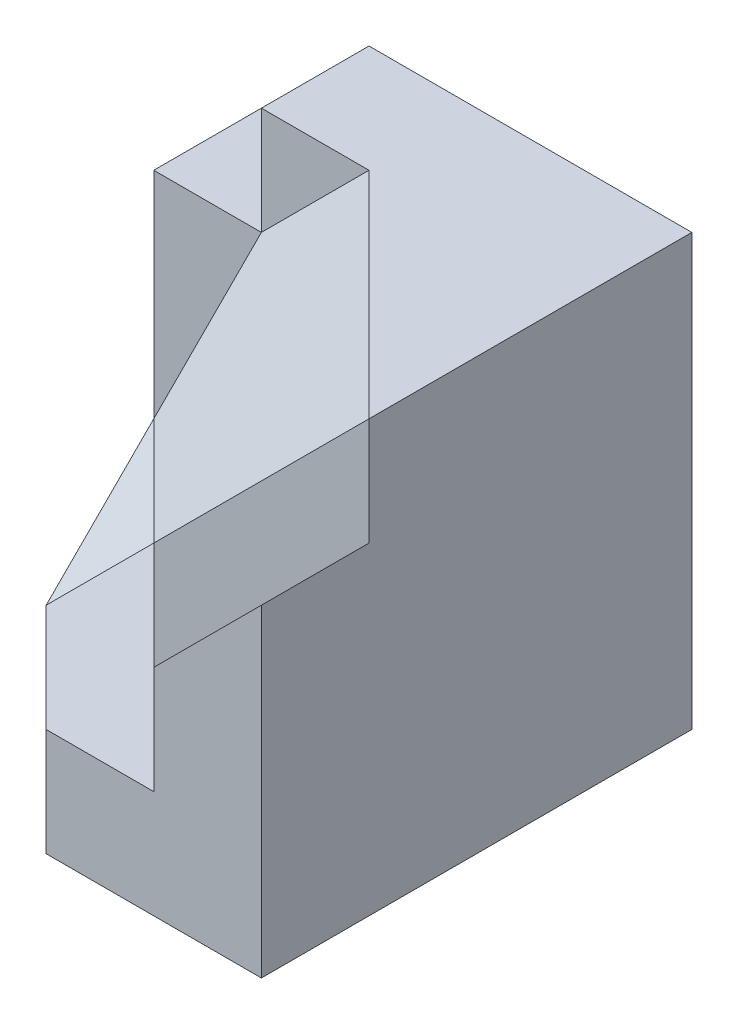
ISO-10303-21;
HEADER;
FILE_DESCRIPTION(('STEP AP214'),'2;1');
FILE_NAME('part.step','',(''),(''),'','','');
FILE_SCHEMA(('AUTOMOTIVE_DESIGN { 1 0 10303 214 1 1 1 1 }'));
ENDSEC;
DATA;
#1=APPLICATION_CONTEXT('core data for automotive mechanical design processes');
#2=APPLICATION_PROTOCOL_DEFINITION('international standard','automotive_design',2000,#1);
#3=PRODUCT_CONTEXT('',#1,'mechanical');
#4=PRODUCT('Part','Part','',(#3));
#5=PRODUCT_RELATED_PRODUCT_CATEGORY('part','',(#4));
#6=PRODUCT_DEFINITION_FORMATION('','',#4);
#7=PRODUCT_DEFINITION_CONTEXT('part definition',#1,'design');
#8=PRODUCT_DEFINITION('design','',#6,#7);
#9=PRODUCT_DEFINITION_SHAPE('','',#8);
#10=(LENGTH_UNIT() NAMED_UNIT(*) SI_UNIT(.MILLI.,.METRE.));
#11=(NAMED_UNIT(*) PLANE_ANGLE_UNIT() SI_UNIT($,.RADIAN.));
#12=(NAMED_UNIT(*) SI_UNIT($,.STERADIAN.) SOLID_ANGLE_UNIT());
#13=UNCERTAINTY_MEASURE_WITH_UNIT(LENGTH_MEASURE(1.E-05),#10,'distance_accuracy_value','');
#14=(GEOMETRIC_REPRESENTATION_CONTEXT(3) GLOBAL_UNCERTAINTY_ASSIGNED_CONTEXT((#13)) GLOBAL_UNIT_ASSIGNED_CONTEXT((#10,
#11,#12)) REPRESENTATION_CONTEXT('',''));
#15=CARTESIAN_POINT('',(0.,0.,0.));
#16=DIRECTION('',(0.,0.,1.));
#17=DIRECTION('',(1.,0.,0.));
#18=AXIS2_PLACEMENT_3D('',#15,#16,#17);
#19=CARTESIAN_POINT('',(-12.5,20.,12.5));
#20=DIRECTION('',(-0.707106781186547,0.,0.707106781186548));
#21=DIRECTION('',(0.707106781186548,0.,0.707106781186547));
#22=AXIS2_PLACEMENT_3D('',#19,#20,#21);
#23=PLANE('',#22);
#24=DIRECTION('',(0.,-1.,0.));
#25=VECTOR('',#24,1.);
#26=CARTESIAN_POINT('',(-15.,20.,10.));
#27=LINE('',#26,#25);
#28=CARTESIAN_POINT('',(-15.,10.,10.));
#29=VERTEX_POINT('',#28);
#30=CARTESIAN_POINT('',(-15.,5.,10.));
#31=VERTEX_POINT('',#30);
#32=EDGE_CURVE('E161',#29,#31,#27,.T.);
#33=ORIENTED_EDGE('',*,*,#32,.T.);
#34=DIRECTION('',(0.707106781186548,0.,0.707106781186547));
#35=VECTOR('',#34,1.);
#36=CARTESIAN_POINT('',(-15.,5.,10.));
#37=LINE('',#36,#35);
#38=CARTESIAN_POINT('',(-10.,5.,15.));
#39=VERTEX_POINT('',#38);
#40=EDGE_CURVE('E146',#31,#39,#37,.T.);
#41=ORIENTED_EDGE('',*,*,#40,.T.);
#42=DIRECTION('',(0.,-1.,0.));
#43=VECTOR('',#42,1.);
#44=CARTESIAN_POINT('',(-10.,20.,15.));
#45=LINE('',#44,#43);
#46=CARTESIAN_POINT('',(-10.,10.,15.));
#47=VERTEX_POINT('',#46);
#48=EDGE_CURVE('E171',#47,#39,#45,.T.);
#49=ORIENTED_EDGE('',*,*,#48,.F.);
#50=DIRECTION('',(-0.707106781186548,0.,-0.707106781186547));
#51=VECTOR('',#50,1.);
#52=CARTESIAN_POINT('',(-10.,10.,15.));
#53=LINE('',#52,#51);
#54=EDGE_CURVE('E167',#47,#29,#53,.T.);
#55=ORIENTED_EDGE('',*,*,#54,.T.);
#56=EDGE_LOOP('',(#33,#41,#49,#55));
#57=FACE_BOUND('',#56,.T.);
#58=ADVANCED_FACE('F36',(#57),#23,.T.);
#59=CARTESIAN_POINT('',(0.,20.,15.));
#60=DIRECTION('',(0.,0.,1.));
#61=DIRECTION('',(1.,0.,0.));
#62=AXIS2_PLACEMENT_3D('',#59,#60,#61);
#63=PLANE('',#62);
#64=ORIENTED_EDGE('',*,*,#48,.T.);
#65=DIRECTION('',(1.,0.,0.));
#66=VECTOR('',#65,1.);
#67=CARTESIAN_POINT('',(-10.,5.,15.));
#68=LINE('',#67,#66);
#69=CARTESIAN_POINT('',(-5.,5.,15.));
#70=VERTEX_POINT('',#69);
#71=EDGE_CURVE('E153',#39,#70,#68,.T.);
#72=ORIENTED_EDGE('',*,*,#71,.T.);
#73=DIRECTION('',(0.,-1.,0.));
#74=VECTOR('',#73,1.);
#75=CARTESIAN_POINT('',(-5.,0.,15.));
#76=LINE('',#75,#74);
#77=CARTESIAN_POINT('',(-5.,10.,15.));
#78=VERTEX_POINT('',#77);
#79=EDGE_CURVE('E268',#78,#70,#76,.T.);
#80=ORIENTED_EDGE('',*,*,#79,.F.);
#81=DIRECTION('',(0.707106781186547,0.707106781186548,0.));
#82=VECTOR('',#81,1.);
#83=CARTESIAN_POINT('',(-5.,10.,15.));
#84=LINE('',#83,#82);
#85=CARTESIAN_POINT('',(0.,15.,15.));
#86=VERTEX_POINT('',#85);
#87=EDGE_CURVE('E272',#78,#86,#84,.T.);
#88=ORIENTED_EDGE('',*,*,#87,.T.);
#89=DIRECTION('',(0.,-1.,0.));
#90=VECTOR('',#89,1.);
#91=CARTESIAN_POINT('',(0.,20.,15.));
#92=LINE('',#91,#90);
#93=CARTESIAN_POINT('',(0.,20.,15.));
#94=VERTEX_POINT('',#93);
#95=EDGE_CURVE('E12',#94,#86,#92,.T.);
#96=ORIENTED_EDGE('',*,*,#95,.F.);
#97=DIRECTION('',(-0.707106781186548,-0.707106781186548,0.));
#98=VECTOR('',#97,1.);
#99=CARTESIAN_POINT('',(0.,20.,15.));
#100=LINE('',#99,#98);
#101=EDGE_CURVE('E61',#94,#47,#100,.T.);
#102=ORIENTED_EDGE('',*,*,#101,.T.);
#103=EDGE_LOOP('',(#64,#72,#80,#88,#96,#102));
#104=FACE_BOUND('',#103,.T.);
#105=ADVANCED_FACE('F305',(#104),#63,.T.);
#106=CARTESIAN_POINT('',(-5.,0.,20.));
#107=DIRECTION('',(1.,0.,0.));
#108=DIRECTION('',(0.,0.,-1.));
#109=AXIS2_PLACEMENT_3D('',#106,#107,#108);
#110=PLANE('',#109);
#111=DIRECTION('',(0.,0.,1.));
#112=VECTOR('',#111,1.);
#113=CARTESIAN_POINT('',(-5.,5.,15.));
#114=LINE('',#113,#112);
#115=CARTESIAN_POINT('',(-5.,5.,20.));
#116=VERTEX_POINT('',#115);
#117=EDGE_CURVE('E356',#70,#116,#114,.T.);
#118=ORIENTED_EDGE('',*,*,#117,.T.);
#119=DIRECTION('',(0.,-1.,0.));
#120=VECTOR('',#119,1.);
#121=CARTESIAN_POINT('',(-5.,0.,20.));
#122=LINE('',#121,#120);
#123=CARTESIAN_POINT('',(-5.,10.,20.));
#124=VERTEX_POINT('',#123);
#125=EDGE_CURVE('E346',#124,#116,#122,.T.);
#126=ORIENTED_EDGE('',*,*,#125,.F.);
#127=DIRECTION('',(0.,0.,1.));
#128=VECTOR('',#127,1.);
#129=CARTESIAN_POINT('',(-5.,10.,15.));
#130=LINE('',#129,#128);
#131=EDGE_CURVE('E53',#78,#124,#130,.T.);
#132=ORIENTED_EDGE('',*,*,#131,.F.);
#133=ORIENTED_EDGE('',*,*,#79,.T.);
#134=EDGE_LOOP('',(#118,#126,#132,#133));
#135=FACE_BOUND('',#134,.T.);
#136=ADVANCED_FACE('F355',(#135),#110,.F.);
#137=CARTESIAN_POINT('',(-15.,20.,5.));
#138=DIRECTION('',(1.,0.,0.));
#139=DIRECTION('',(0.,0.,-1.));
#140=AXIS2_PLACEMENT_3D('',#137,#138,#139);
#141=PLANE('',#140);
#142=DIRECTION('',(0.,0.707106781186547,-0.707106781186548));
#143=VECTOR('',#142,1.);
#144=CARTESIAN_POINT('',(-15.,10.,10.));
#145=LINE('',#144,#143);
#146=CARTESIAN_POINT('',(-15.,15.,5.));
#147=VERTEX_POINT('',#146);
#148=EDGE_CURVE('E264',#29,#147,#145,.T.);
#149=ORIENTED_EDGE('',*,*,#148,.T.);
#150=DIRECTION('',(0.,-1.,0.));
#151=VECTOR('',#150,1.);
#152=CARTESIAN_POINT('',(-15.,20.,5.));
#153=LINE('',#152,#151);
#154=CARTESIAN_POINT('',(-15.,5.,5.));
#155=VERTEX_POINT('',#154);
#156=EDGE_CURVE('E168',#147,#155,#153,.T.);
#157=ORIENTED_EDGE('',*,*,#156,.T.);
#158=DIRECTION('',(0.,0.707106781186547,-0.707106781186548));
#159=VECTOR('',#158,1.);
#160=CARTESIAN_POINT('',(-15.,5.,5.));
#161=LINE('',#160,#159);
#162=CARTESIAN_POINT('',(-15.,0.,10.));
#163=VERTEX_POINT('',#162);
#164=EDGE_CURVE('E205',#163,#155,#161,.T.);
#165=ORIENTED_EDGE('',*,*,#164,.F.);
#166=DIRECTION('',(0.,0.,-1.));
#167=VECTOR('',#166,1.);
#168=CARTESIAN_POINT('',(-15.,0.,15.));
#169=LINE('',#168,#167);
#170=CARTESIAN_POINT('',(-15.,0.,15.));
#171=VERTEX_POINT('',#170);
#172=EDGE_CURVE('E326',#171,#163,#169,.T.);
#173=ORIENTED_EDGE('',*,*,#172,.F.);
#174=DIRECTION('',(0.,-1.,0.));
#175=VECTOR('',#174,1.);
#176=CARTESIAN_POINT('',(-15.,5.,15.));
#177=LINE('',#176,#175);
#178=CARTESIAN_POINT('',(-15.,5.,15.));
#179=VERTEX_POINT('',#178);
#180=EDGE_CURVE('E163',#179,#171,#177,.T.);
#181=ORIENTED_EDGE('',*,*,#180,.F.);
#182=DIRECTION('',(0.,0.,-1.));
#183=VECTOR('',#182,1.);
#184=CARTESIAN_POINT('',(-15.,5.,15.));
#185=LINE('',#184,#183);
#186=EDGE_CURVE('E150',#179,#31,#185,.T.);
#187=ORIENTED_EDGE('',*,*,#186,.T.);
#188=ORIENTED_EDGE('',*,*,#32,.F.);
#189=EDGE_LOOP('',(#149,#157,#165,#173,#181,#187,#188));
#190=FACE_BOUND('',#189,.T.);
#191=ADVANCED_FACE('F38',(#190),#141,.F.);
#192=DIRECTION('',(0.,1.,0.));
#193=VECTOR('',#192,1.);
#194=CARTESIAN_POINT('',(-15.,15.,5.));
#195=LINE('',#194,#193);
#196=CARTESIAN_POINT('',(-15.,20.,5.));
#197=VERTEX_POINT('',#196);
#198=EDGE_CURVE('E277',#147,#197,#195,.T.);
#199=ORIENTED_EDGE('',*,*,#198,.T.);
#200=DIRECTION('',(0.,0.,1.));
#201=VECTOR('',#200,1.);
#202=CARTESIAN_POINT('',(-15.,20.,5.));
#203=LINE('',#202,#201);
#204=CARTESIAN_POINT('',(-15.,20.,0.));
#205=VERTEX_POINT('',#204);
#206=EDGE_CURVE('E240',#205,#197,#203,.T.);
#207=ORIENTED_EDGE('',*,*,#206,.F.);
#208=DIRECTION('',(0.,-1.,0.));
#209=VECTOR('',#208,1.);
#210=CARTESIAN_POINT('',(-15.,20.,0.));
#211=LINE('',#210,#209);
#212=CARTESIAN_POINT('',(-15.,15.,0.));
#213=VERTEX_POINT('',#212);
#214=EDGE_CURVE('E206',#205,#213,#211,.T.);
#215=ORIENTED_EDGE('',*,*,#214,.T.);
#216=DIRECTION('',(0.,0.,-1.));
#217=VECTOR('',#216,1.);
#218=CARTESIAN_POINT('',(-15.,15.,0.));
#219=LINE('',#218,#217);
#220=EDGE_CURVE('E188',#147,#213,#219,.T.);
#221=ORIENTED_EDGE('',*,*,#220,.F.);
#222=EDGE_LOOP('',(#199,#207,#215,#221));
#223=FACE_BOUND('',#222,.T.);
#224=ADVANCED_FACE('F312',(#223),#141,.F.);
#225=CARTESIAN_POINT('',(0.,20.,0.));
#226=DIRECTION('',(0.,-1.,0.));
#227=DIRECTION('',(0.,0.,-1.));
#228=AXIS2_PLACEMENT_3D('',#225,#226,#227);
#229=PLANE('',#228);
#230=DIRECTION('',(0.707106781186548,0.,0.707106781186547));
#231=VECTOR('',#230,1.);
#232=CARTESIAN_POINT('',(-10.,20.,5.));
#233=LINE('',#232,#231);
#234=CARTESIAN_POINT('',(-10.,20.,5.));
#235=VERTEX_POINT('',#234);
#236=EDGE_CURVE('E287',#235,#94,#233,.T.);
#237=ORIENTED_EDGE('',*,*,#236,.T.);
#238=DIRECTION('',(0.,0.,-1.));
#239=VECTOR('',#238,1.);
#240=CARTESIAN_POINT('',(0.,20.,0.));
#241=LINE('',#240,#239);
#242=CARTESIAN_POINT('',(0.,20.,0.));
#243=VERTEX_POINT('',#242);
#244=EDGE_CURVE('E252',#94,#243,#241,.T.);
#245=ORIENTED_EDGE('',*,*,#244,.T.);
#246=DIRECTION('',(-1.,0.,0.));
#247=VECTOR('',#246,1.);
#248=CARTESIAN_POINT('',(-15.,20.,0.));
#249=LINE('',#248,#247);
#250=EDGE_CURVE('E243',#243,#205,#249,.T.);
#251=ORIENTED_EDGE('',*,*,#250,.T.);
#252=ORIENTED_EDGE('',*,*,#206,.T.);
#253=DIRECTION('',(-1.,0.,0.));
#254=VECTOR('',#253,1.);
#255=CARTESIAN_POINT('',(0.,20.,5.));
#256=LINE('',#255,#254);
#257=EDGE_CURVE('E169',#235,#197,#256,.T.);
#258=ORIENTED_EDGE('',*,*,#257,.F.);
#259=EDGE_LOOP('',(#237,#245,#251,#252,#258));
#260=FACE_BOUND('',#259,.T.);
#261=ADVANCED_FACE('F302',(#260),#229,.F.);
#262=CARTESIAN_POINT('',(-10.,20.,5.));
#263=DIRECTION('',(0.,0.,-1.));
#264=DIRECTION('',(-1.,0.,0.));
#265=AXIS2_PLACEMENT_3D('',#262,#263,#264);
#266=PLANE('',#265);
#267=DIRECTION('',(1.,0.,0.));
#268=VECTOR('',#267,1.);
#269=CARTESIAN_POINT('',(-20.,5.,5.));
#270=LINE('',#269,#268);
#271=CARTESIAN_POINT('',(-20.,5.,5.));
#272=VERTEX_POINT('',#271);
#273=EDGE_CURVE('E216',#272,#155,#270,.T.);
#274=ORIENTED_EDGE('',*,*,#273,.T.);
#275=ORIENTED_EDGE('',*,*,#156,.F.);
#276=DIRECTION('',(1.,0.,0.));
#277=VECTOR('',#276,1.);
#278=CARTESIAN_POINT('',(-20.,15.,5.));
#279=LINE('',#278,#277);
#280=CARTESIAN_POINT('',(-20.,15.,5.));
#281=VERTEX_POINT('',#280);
#282=EDGE_CURVE('E211',#281,#147,#279,.T.);
#283=ORIENTED_EDGE('',*,*,#282,.F.);
#284=DIRECTION('',(0.,1.,0.));
#285=VECTOR('',#284,1.);
#286=CARTESIAN_POINT('',(-20.,15.,5.));
#287=LINE('',#286,#285);
#288=EDGE_CURVE('E192',#272,#281,#287,.T.);
#289=ORIENTED_EDGE('',*,*,#288,.F.);
#290=EDGE_LOOP('',(#274,#275,#283,#289));
#291=FACE_BOUND('',#290,.T.);
#292=ADVANCED_FACE('F318',(#291),#266,.F.);
#293=CARTESIAN_POINT('',(0.,20.,0.));
#294=DIRECTION('',(-1.,0.,0.));
#295=DIRECTION('',(0.,0.,1.));
#296=AXIS2_PLACEMENT_3D('',#293,#294,#295);
#297=PLANE('',#296);
#298=DIRECTION('',(0.,0.,-1.));
#299=VECTOR('',#298,1.);
#300=CARTESIAN_POINT('',(0.,0.,0.));
#301=LINE('',#300,#299);
#302=CARTESIAN_POINT('',(0.,0.,20.));
#303=VERTEX_POINT('',#302);
#304=CARTESIAN_POINT('',(0.,0.,0.));
#305=VERTEX_POINT('',#304);
#306=EDGE_CURVE('E230',#303,#305,#301,.T.);
#307=ORIENTED_EDGE('',*,*,#306,.T.);
#308=DIRECTION('',(0.,-1.,0.));
#309=VECTOR('',#308,1.);
#310=CARTESIAN_POINT('',(0.,20.,0.));
#311=LINE('',#310,#309);
#312=EDGE_CURVE('E45',#243,#305,#311,.T.);
#313=ORIENTED_EDGE('',*,*,#312,.F.);
#314=ORIENTED_EDGE('',*,*,#244,.F.);
#315=ORIENTED_EDGE('',*,*,#95,.T.);
#316=DIRECTION('',(0.,0.,-1.));
#317=VECTOR('',#316,1.);
#318=CARTESIAN_POINT('',(0.,15.,20.));
#319=LINE('',#318,#317);
#320=CARTESIAN_POINT('',(0.,15.,20.));
#321=VERTEX_POINT('',#320);
#322=EDGE_CURVE('E262',#321,#86,#319,.T.);
#323=ORIENTED_EDGE('',*,*,#322,.F.);
#324=DIRECTION('',(0.,1.,0.));
#325=VECTOR('',#324,1.);
#326=CARTESIAN_POINT('',(0.,0.,20.));
#327=LINE('',#326,#325);
#328=EDGE_CURVE('E271',#303,#321,#327,.T.);
#329=ORIENTED_EDGE('',*,*,#328,.F.);
#330=EDGE_LOOP('',(#307,#313,#314,#315,#323,#329));
#331=FACE_BOUND('',#330,.T.);
#332=ADVANCED_FACE('F308',(#331),#297,.F.);
#333=CARTESIAN_POINT('',(-15.,20.,0.));
#334=DIRECTION('',(0.,0.,1.));
#335=DIRECTION('',(1.,0.,0.));
#336=AXIS2_PLACEMENT_3D('',#333,#334,#335);
#337=PLANE('',#336);
#338=DIRECTION('',(-1.,0.,0.));
#339=VECTOR('',#338,1.);
#340=CARTESIAN_POINT('',(-15.,0.,0.));
#341=LINE('',#340,#339);
#342=CARTESIAN_POINT('',(-20.,0.,0.));
#343=VERTEX_POINT('',#342);
#344=EDGE_CURVE('E234',#305,#343,#341,.T.);
#345=ORIENTED_EDGE('',*,*,#344,.T.);
#346=DIRECTION('',(0.,-1.,0.));
#347=VECTOR('',#346,1.);
#348=CARTESIAN_POINT('',(-20.,0.,0.));
#349=LINE('',#348,#347);
#350=CARTESIAN_POINT('',(-20.,15.,0.));
#351=VERTEX_POINT('',#350);
#352=EDGE_CURVE('E184',#351,#343,#349,.T.);
#353=ORIENTED_EDGE('',*,*,#352,.F.);
#354=DIRECTION('',(1.,0.,0.));
#355=VECTOR('',#354,1.);
#356=CARTESIAN_POINT('',(-20.,15.,0.));
#357=LINE('',#356,#355);
#358=EDGE_CURVE('E196',#351,#213,#357,.T.);
#359=ORIENTED_EDGE('',*,*,#358,.T.);
#360=ORIENTED_EDGE('',*,*,#214,.F.);
#361=ORIENTED_EDGE('',*,*,#250,.F.);
#362=ORIENTED_EDGE('',*,*,#312,.T.);
#363=EDGE_LOOP('',(#345,#353,#359,#360,#361,#362));
#364=FACE_BOUND('',#363,.T.);
#365=ADVANCED_FACE('F309',(#364),#337,.F.);
#366=CARTESIAN_POINT('',(0.,0.,0.));
#367=DIRECTION('',(0.,-1.,0.));
#368=DIRECTION('',(0.,0.,-1.));
#369=AXIS2_PLACEMENT_3D('',#366,#367,#368);
#370=PLANE('',#369);
#371=ORIENTED_EDGE('',*,*,#172,.T.);
#372=DIRECTION('',(1.,0.,0.));
#373=VECTOR('',#372,1.);
#374=CARTESIAN_POINT('',(-20.,0.,10.));
#375=LINE('',#374,#373);
#376=CARTESIAN_POINT('',(-20.,0.,10.));
#377=VERTEX_POINT('',#376);
#378=EDGE_CURVE('E199',#377,#163,#375,.T.);
#379=ORIENTED_EDGE('',*,*,#378,.F.);
#380=DIRECTION('',(0.,0.,1.));
#381=VECTOR('',#380,1.);
#382=CARTESIAN_POINT('',(-20.,0.,0.));
#383=LINE('',#382,#381);
#384=EDGE_CURVE('E187',#343,#377,#383,.T.);
#385=ORIENTED_EDGE('',*,*,#384,.F.);
#386=ORIENTED_EDGE('',*,*,#344,.F.);
#387=ORIENTED_EDGE('',*,*,#306,.F.);
#388=DIRECTION('',(1.,0.,0.));
#389=VECTOR('',#388,1.);
#390=CARTESIAN_POINT('',(0.,0.,20.));
#391=LINE('',#390,#389);
#392=CARTESIAN_POINT('',(-10.,0.,20.));
#393=VERTEX_POINT('',#392);
#394=EDGE_CURVE('E265',#393,#303,#391,.T.);
#395=ORIENTED_EDGE('',*,*,#394,.F.);
#396=DIRECTION('',(-0.707106781186548,0.,-0.707106781186547));
#397=VECTOR('',#396,1.);
#398=CARTESIAN_POINT('',(-10.,0.,20.));
#399=LINE('',#398,#397);
#400=EDGE_CURVE('E164',#393,#171,#399,.T.);
#401=ORIENTED_EDGE('',*,*,#400,.T.);
#402=EDGE_LOOP('',(#371,#379,#385,#386,#387,#395,#401));
#403=FACE_BOUND('',#402,.T.);
#404=ADVANCED_FACE('F331',(#403),#370,.T.);
#405=CARTESIAN_POINT('',(-20.,5.,5.));
#406=DIRECTION('',(0.,-0.707106781186548,-0.707106781186547));
#407=DIRECTION('',(0.,0.707106781186547,-0.707106781186548));
#408=AXIS2_PLACEMENT_3D('',#405,#406,#407);
#409=PLANE('',#408);
#410=ORIENTED_EDGE('',*,*,#164,.T.);
#411=ORIENTED_EDGE('',*,*,#273,.F.);
#412=DIRECTION('',(0.,0.707106781186547,-0.707106781186548));
#413=VECTOR('',#412,1.);
#414=CARTESIAN_POINT('',(-20.,5.,5.));
#415=LINE('',#414,#413);
#416=EDGE_CURVE('E190',#377,#272,#415,.T.);
#417=ORIENTED_EDGE('',*,*,#416,.F.);
#418=ORIENTED_EDGE('',*,*,#378,.T.);
#419=EDGE_LOOP('',(#410,#411,#417,#418));
#420=FACE_BOUND('',#419,.T.);
#421=ADVANCED_FACE('F325',(#420),#409,.F.);
#422=CARTESIAN_POINT('',(-20.,15.,0.));
#423=DIRECTION('',(0.,-1.,0.));
#424=DIRECTION('',(0.,0.,-1.));
#425=AXIS2_PLACEMENT_3D('',#422,#423,#424);
#426=PLANE('',#425);
#427=ORIENTED_EDGE('',*,*,#220,.T.);
#428=ORIENTED_EDGE('',*,*,#358,.F.);
#429=DIRECTION('',(0.,0.,-1.));
#430=VECTOR('',#429,1.);
#431=CARTESIAN_POINT('',(-20.,15.,0.));
#432=LINE('',#431,#430);
#433=EDGE_CURVE('E194',#281,#351,#432,.T.);
#434=ORIENTED_EDGE('',*,*,#433,.F.);
#435=ORIENTED_EDGE('',*,*,#282,.T.);
#436=EDGE_LOOP('',(#427,#428,#434,#435));
#437=FACE_BOUND('',#436,.T.);
#438=ADVANCED_FACE('F321',(#437),#426,.F.);
#439=CARTESIAN_POINT('',(-20.,0.,0.));
#440=DIRECTION('',(1.,0.,0.));
#441=DIRECTION('',(0.,0.,-1.));
#442=AXIS2_PLACEMENT_3D('',#439,#440,#441);
#443=PLANE('',#442);
#444=ORIENTED_EDGE('',*,*,#352,.T.);
#445=ORIENTED_EDGE('',*,*,#384,.T.);
#446=ORIENTED_EDGE('',*,*,#416,.T.);
#447=ORIENTED_EDGE('',*,*,#288,.T.);
#448=ORIENTED_EDGE('',*,*,#433,.T.);
#449=EDGE_LOOP('',(#444,#445,#446,#447,#448));
#450=FACE_BOUND('',#449,.T.);
#451=ADVANCED_FACE('F323',(#450),#443,.F.);
#452=CARTESIAN_POINT('',(-15.,15.,5.));
#453=DIRECTION('',(0.,0.,1.));
#454=DIRECTION('',(1.,0.,0.));
#455=AXIS2_PLACEMENT_3D('',#452,#453,#454);
#456=PLANE('',#455);
#457=ORIENTED_EDGE('',*,*,#257,.T.);
#458=ORIENTED_EDGE('',*,*,#198,.F.);
#459=DIRECTION('',(0.707106781186548,0.707106781186548,0.));
#460=VECTOR('',#459,1.);
#461=CARTESIAN_POINT('',(-15.,15.,5.));
#462=LINE('',#461,#460);
#463=EDGE_CURVE('E173',#147,#235,#462,.T.);
#464=ORIENTED_EDGE('',*,*,#463,.T.);
#465=EDGE_LOOP('',(#457,#458,#464));
#466=FACE_BOUND('',#465,.T.);
#467=ADVANCED_FACE('F315',(#466),#456,.T.);
#468=CARTESIAN_POINT('',(-11.6666666666667,11.6666666666667,11.6666666666667));
#469=DIRECTION('',(-0.577350269189626,0.577350269189626,0.577350269189626));
#470=DIRECTION('',(0.,-0.707106781186548,0.707106781186547));
#471=AXIS2_PLACEMENT_3D('',#468,#469,#470);
#472=PLANE('',#471);
#473=ORIENTED_EDGE('',*,*,#463,.F.);
#474=ORIENTED_EDGE('',*,*,#148,.F.);
#475=ORIENTED_EDGE('',*,*,#54,.F.);
#476=ORIENTED_EDGE('',*,*,#101,.F.);
#477=ORIENTED_EDGE('',*,*,#236,.F.);
#478=EDGE_LOOP('',(#473,#474,#475,#476,#477));
#479=FACE_BOUND('',#478,.T.);
#480=ADVANCED_FACE('F431',(#479),#472,.T.);
#481=CARTESIAN_POINT('',(0.,0.,20.));
#482=DIRECTION('',(0.,0.,1.));
#483=DIRECTION('',(1.,0.,0.));
#484=AXIS2_PLACEMENT_3D('',#481,#482,#483);
#485=PLANE('',#484);
#486=DIRECTION('',(0.707106781186547,0.707106781186548,0.));
#487=VECTOR('',#486,1.);
#488=CARTESIAN_POINT('',(-5.,10.,20.));
#489=LINE('',#488,#487);
#490=EDGE_CURVE('E339',#124,#321,#489,.T.);
#491=ORIENTED_EDGE('',*,*,#490,.F.);
#492=ORIENTED_EDGE('',*,*,#125,.T.);
#493=DIRECTION('',(-1.,0.,0.));
#494=VECTOR('',#493,1.);
#495=CARTESIAN_POINT('',(-5.,5.,20.));
#496=LINE('',#495,#494);
#497=CARTESIAN_POINT('',(-10.,5.,20.));
#498=VERTEX_POINT('',#497);
#499=EDGE_CURVE('E357',#116,#498,#496,.T.);
#500=ORIENTED_EDGE('',*,*,#499,.T.);
#501=DIRECTION('',(0.,-1.,0.));
#502=VECTOR('',#501,1.);
#503=CARTESIAN_POINT('',(-10.,5.,20.));
#504=LINE('',#503,#502);
#505=EDGE_CURVE('E340',#498,#393,#504,.T.);
#506=ORIENTED_EDGE('',*,*,#505,.T.);
#507=ORIENTED_EDGE('',*,*,#394,.T.);
#508=ORIENTED_EDGE('',*,*,#328,.T.);
#509=EDGE_LOOP('',(#491,#492,#500,#506,#507,#508));
#510=FACE_BOUND('',#509,.T.);
#511=ADVANCED_FACE('F351',(#510),#485,.T.);
#512=CARTESIAN_POINT('',(-5.,10.,15.));
#513=DIRECTION('',(0.707106781186548,-0.707106781186547,0.));
#514=DIRECTION('',(0.707106781186547,0.707106781186548,0.));
#515=AXIS2_PLACEMENT_3D('',#512,#513,#514);
#516=PLANE('',#515);
#517=ORIENTED_EDGE('',*,*,#490,.T.);
#518=ORIENTED_EDGE('',*,*,#322,.T.);
#519=ORIENTED_EDGE('',*,*,#87,.F.);
#520=ORIENTED_EDGE('',*,*,#131,.T.);
#521=EDGE_LOOP('',(#517,#518,#519,#520));
#522=FACE_BOUND('',#521,.T.);
#523=ADVANCED_FACE('F352',(#522),#516,.F.);
#524=CARTESIAN_POINT('',(-10.,5.,20.));
#525=DIRECTION('',(-0.707106781186547,0.,0.707106781186548));
#526=DIRECTION('',(0.707106781186548,0.,0.707106781186547));
#527=AXIS2_PLACEMENT_3D('',#524,#525,#526);
#528=PLANE('',#527);
#529=ORIENTED_EDGE('',*,*,#400,.F.);
#530=ORIENTED_EDGE('',*,*,#505,.F.);
#531=DIRECTION('',(-0.707106781186548,0.,-0.707106781186547));
#532=VECTOR('',#531,1.);
#533=CARTESIAN_POINT('',(-10.,5.,20.));
#534=LINE('',#533,#532);
#535=EDGE_CURVE('E342',#498,#179,#534,.T.);
#536=ORIENTED_EDGE('',*,*,#535,.T.);
#537=ORIENTED_EDGE('',*,*,#180,.T.);
#538=EDGE_LOOP('',(#529,#530,#536,#537));
#539=FACE_BOUND('',#538,.T.);
#540=ADVANCED_FACE('F361',(#539),#528,.T.);
#541=CARTESIAN_POINT('',(0.,5.,0.));
#542=DIRECTION('',(0.,-1.,0.));
#543=DIRECTION('',(0.,0.,-1.));
#544=AXIS2_PLACEMENT_3D('',#541,#542,#543);
#545=PLANE('',#544);
#546=ORIENTED_EDGE('',*,*,#186,.F.);
#547=ORIENTED_EDGE('',*,*,#535,.F.);
#548=ORIENTED_EDGE('',*,*,#499,.F.);
#549=ORIENTED_EDGE('',*,*,#117,.F.);
#550=ORIENTED_EDGE('',*,*,#71,.F.);
#551=ORIENTED_EDGE('',*,*,#40,.F.);
#552=EDGE_LOOP('',(#546,#547,#548,#549,#550,#551));
#553=FACE_BOUND('',#552,.T.);
#554=ADVANCED_FACE('F148',(#553),#545,.F.);
#555=CLOSED_SHELL('',(#58,#105,#136,#191,#224,#261,#292,#332,#365,#404,#421,#438,#451,#467,#480,
#511,#523,#540,#554));
#556=MANIFOLD_SOLID_BREP('B2',#555);
#557=ADVANCED_BREP_SHAPE_REPRESENTATION('',(#18,#556),#14);
#558=SHAPE_DEFINITION_REPRESENTATION(#9,#557);
ENDSEC;
END-ISO-10303-21;
